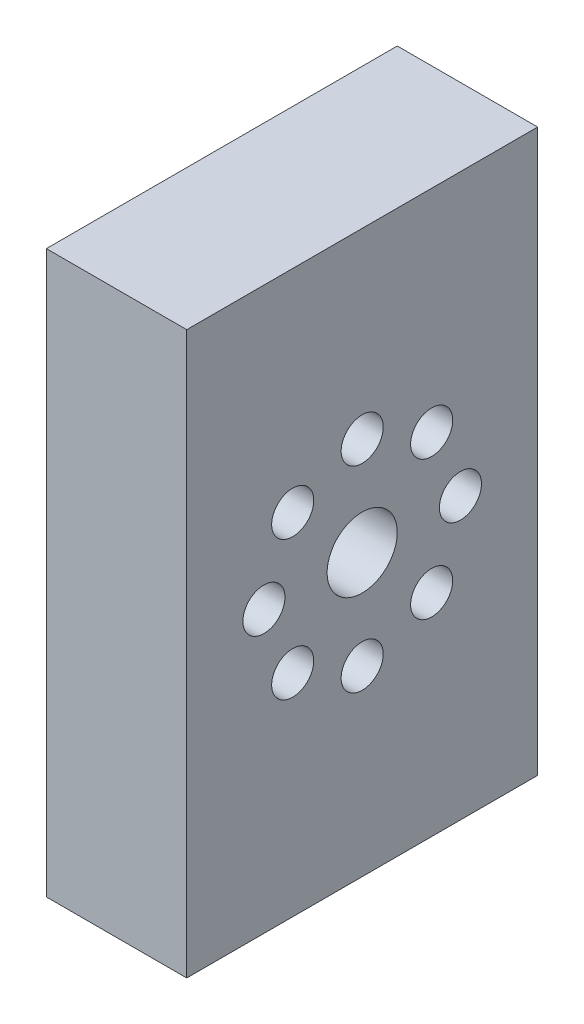
ISO-10303-21;
HEADER;
FILE_DESCRIPTION(('STEP AP214'),'2;1');
FILE_NAME('part.step','',(''),(''),'','','');
FILE_SCHEMA(('AUTOMOTIVE_DESIGN { 1 0 10303 214 1 1 1 1 }'));
ENDSEC;
DATA;
#1=APPLICATION_CONTEXT('core data for automotive mechanical design processes');
#2=APPLICATION_PROTOCOL_DEFINITION('international standard','automotive_design',2000,#1);
#3=PRODUCT_CONTEXT('',#1,'mechanical');
#4=PRODUCT('Part','Part','',(#3));
#5=PRODUCT_RELATED_PRODUCT_CATEGORY('part','',(#4));
#6=PRODUCT_DEFINITION_FORMATION('','',#4);
#7=PRODUCT_DEFINITION_CONTEXT('part definition',#1,'design');
#8=PRODUCT_DEFINITION('design','',#6,#7);
#9=PRODUCT_DEFINITION_SHAPE('','',#8);
#10=(LENGTH_UNIT() NAMED_UNIT(*) SI_UNIT(.MILLI.,.METRE.));
#11=(NAMED_UNIT(*) PLANE_ANGLE_UNIT() SI_UNIT($,.RADIAN.));
#12=(NAMED_UNIT(*) SI_UNIT($,.STERADIAN.) SOLID_ANGLE_UNIT());
#13=UNCERTAINTY_MEASURE_WITH_UNIT(LENGTH_MEASURE(1.E-05),#10,'distance_accuracy_value','');
#14=(GEOMETRIC_REPRESENTATION_CONTEXT(3) GLOBAL_UNCERTAINTY_ASSIGNED_CONTEXT((#13)) GLOBAL_UNIT_ASSIGNED_CONTEXT((#10,
#11,#12)) REPRESENTATION_CONTEXT('',''));
#15=CARTESIAN_POINT('',(0.,0.,0.));
#16=DIRECTION('',(0.,0.,1.));
#17=DIRECTION('',(1.,0.,0.));
#18=AXIS2_PLACEMENT_3D('',#15,#16,#17);
#19=CARTESIAN_POINT('',(-14.4613506272435,0.,0.));
#20=DIRECTION('',(-1.,0.,0.));
#21=DIRECTION('',(0.,0.,1.));
#22=AXIS2_PLACEMENT_3D('',#19,#20,#21);
#23=PLANE('',#22);
#24=CARTESIAN_POINT('',(-14.4613506272435,0.,0.));
#25=DIRECTION('',(-1.,0.,0.));
#26=DIRECTION('',(0.,0.,1.));
#27=AXIS2_PLACEMENT_3D('',#24,#25,#26);
#28=CIRCLE('',#27,2.5);
#29=CARTESIAN_POINT('',(-14.4613506272435,0.,2.5));
#30=VERTEX_POINT('',#29);
#31=EDGE_CURVE('E109',#30,#30,#28,.T.);
#32=ORIENTED_EDGE('',*,*,#31,.T.);
#33=EDGE_LOOP('',(#32));
#34=FACE_BOUND('',#33,.T.);
#35=CARTESIAN_POINT('',(-14.4613506272435,-7.,0.));
#36=DIRECTION('',(1.,0.,0.));
#37=DIRECTION('',(0.,0.,1.));
#38=AXIS2_PLACEMENT_3D('',#35,#36,#37);
#39=CIRCLE('',#38,1.5);
#40=CARTESIAN_POINT('',(-14.4613506272435,-7.,1.5));
#41=VERTEX_POINT('',#40);
#42=EDGE_CURVE('E130',#41,#41,#39,.T.);
#43=ORIENTED_EDGE('',*,*,#42,.F.);
#44=EDGE_LOOP('',(#43));
#45=FACE_BOUND('',#44,.T.);
#46=CARTESIAN_POINT('',(-14.4613506272435,-4.94974746830601,4.94974746830591));
#47=DIRECTION('',(1.,0.,0.));
#48=DIRECTION('',(0.,0.,1.));
#49=AXIS2_PLACEMENT_3D('',#46,#47,#48);
#50=CIRCLE('',#49,1.5);
#51=CARTESIAN_POINT('',(-14.4613506272435,-4.94974746830601,6.44974746830591));
#52=VERTEX_POINT('',#51);
#53=EDGE_CURVE('E118',#52,#52,#50,.T.);
#54=ORIENTED_EDGE('',*,*,#53,.F.);
#55=EDGE_LOOP('',(#54));
#56=FACE_BOUND('',#55,.T.);
#57=CARTESIAN_POINT('',(-14.4613506272435,-4.94974746830565,-4.94974746830576));
#58=DIRECTION('',(1.,0.,0.));
#59=DIRECTION('',(0.,0.,1.));
#60=AXIS2_PLACEMENT_3D('',#57,#58,#59);
#61=CIRCLE('',#60,1.5);
#62=CARTESIAN_POINT('',(-14.4613506272435,-4.94974746830565,-3.44974746830576));
#63=VERTEX_POINT('',#62);
#64=EDGE_CURVE('E125',#63,#63,#61,.T.);
#65=ORIENTED_EDGE('',*,*,#64,.F.);
#66=EDGE_LOOP('',(#65));
#67=FACE_BOUND('',#66,.T.);
#68=CARTESIAN_POINT('',(-14.4613506272435,7.,0.));
#69=DIRECTION('',(-1.,0.,0.));
#70=DIRECTION('',(0.,0.,1.));
#71=AXIS2_PLACEMENT_3D('',#68,#69,#70);
#72=CIRCLE('',#71,1.5);
#73=CARTESIAN_POINT('',(-14.4613506272435,7.,1.5));
#74=VERTEX_POINT('',#73);
#75=EDGE_CURVE('E101',#74,#74,#72,.T.);
#76=ORIENTED_EDGE('',*,*,#75,.T.);
#77=EDGE_LOOP('',(#76));
#78=FACE_BOUND('',#77,.T.);
#79=CARTESIAN_POINT('',(-14.4613506272435,4.94974746830601,4.94974746830591));
#80=DIRECTION('',(-1.,0.,0.));
#81=DIRECTION('',(0.,0.,1.));
#82=AXIS2_PLACEMENT_3D('',#79,#80,#81);
#83=CIRCLE('',#82,1.5);
#84=CARTESIAN_POINT('',(-14.4613506272435,4.94974746830601,6.44974746830591));
#85=VERTEX_POINT('',#84);
#86=EDGE_CURVE('E136',#85,#85,#83,.T.);
#87=ORIENTED_EDGE('',*,*,#86,.T.);
#88=EDGE_LOOP('',(#87));
#89=FACE_BOUND('',#88,.T.);
#90=CARTESIAN_POINT('',(-14.4613506272435,-2.55611687853764E-13,-6.99999999999975));
#91=DIRECTION('',(-1.,0.,0.));
#92=DIRECTION('',(0.,0.,1.));
#93=AXIS2_PLACEMENT_3D('',#90,#91,#92);
#94=CIRCLE('',#93,1.5);
#95=CARTESIAN_POINT('',(-14.4613506272435,-2.55611687853764E-13,-5.49999999999975));
#96=VERTEX_POINT('',#95);
#97=EDGE_CURVE('E148',#96,#96,#94,.T.);
#98=ORIENTED_EDGE('',*,*,#97,.T.);
#99=EDGE_LOOP('',(#98));
#100=FACE_BOUND('',#99,.T.);
#101=CARTESIAN_POINT('',(-14.4613506272435,4.94974746830565,-4.94974746830576));
#102=DIRECTION('',(-1.,0.,0.));
#103=DIRECTION('',(0.,0.,1.));
#104=AXIS2_PLACEMENT_3D('',#101,#102,#103);
#105=CIRCLE('',#104,1.5);
#106=CARTESIAN_POINT('',(-14.4613506272435,4.94974746830565,-3.44974746830576));
#107=VERTEX_POINT('',#106);
#108=EDGE_CURVE('E154',#107,#107,#105,.T.);
#109=ORIENTED_EDGE('',*,*,#108,.T.);
#110=EDGE_LOOP('',(#109));
#111=FACE_BOUND('',#110,.T.);
#112=CARTESIAN_POINT('',(-14.4613506272435,2.54754435094361E-13,7.00000000000025));
#113=DIRECTION('',(-1.,0.,0.));
#114=DIRECTION('',(0.,0.,1.));
#115=AXIS2_PLACEMENT_3D('',#112,#113,#114);
#116=CIRCLE('',#115,1.5);
#117=CARTESIAN_POINT('',(-14.4613506272435,2.54754435094361E-13,8.50000000000025));
#118=VERTEX_POINT('',#117);
#119=EDGE_CURVE('E142',#118,#118,#116,.T.);
#120=ORIENTED_EDGE('',*,*,#119,.T.);
#121=EDGE_LOOP('',(#120));
#122=FACE_BOUND('',#121,.T.);
#123=DIRECTION('',(0.,-1.,0.));
#124=VECTOR('',#123,1.);
#125=CARTESIAN_POINT('',(-14.4613506272435,-36.111814630847,-12.5000001862645));
#126=LINE('',#125,#124);
#127=CARTESIAN_POINT('',(-14.4613506272435,20.,-12.5000001862645));
#128=VERTEX_POINT('',#127);
#129=CARTESIAN_POINT('',(-14.4613506272435,-20.,-12.5000001862645));
#130=VERTEX_POINT('',#129);
#131=EDGE_CURVE('E94',#128,#130,#126,.T.);
#132=ORIENTED_EDGE('',*,*,#131,.F.);
#133=DIRECTION('',(0.,0.,1.));
#134=VECTOR('',#133,1.);
#135=CARTESIAN_POINT('',(-14.4613506272435,20.,0.));
#136=LINE('',#135,#134);
#137=CARTESIAN_POINT('',(-14.4613506272435,20.,12.5000001862645));
#138=VERTEX_POINT('',#137);
#139=EDGE_CURVE('E115',#128,#138,#136,.T.);
#140=ORIENTED_EDGE('',*,*,#139,.T.);
#141=DIRECTION('',(0.,1.,0.));
#142=VECTOR('',#141,1.);
#143=CARTESIAN_POINT('',(-14.4613506272435,34.988607051957,12.5000001862645));
#144=LINE('',#143,#142);
#145=CARTESIAN_POINT('',(-14.4613506272435,-20.,12.5000001862645));
#146=VERTEX_POINT('',#145);
#147=EDGE_CURVE('E86',#146,#138,#144,.T.);
#148=ORIENTED_EDGE('',*,*,#147,.F.);
#149=DIRECTION('',(0.,0.,-1.));
#150=VECTOR('',#149,1.);
#151=CARTESIAN_POINT('',(-14.4613506272435,-20.,0.));
#152=LINE('',#151,#150);
#153=EDGE_CURVE('E113',#146,#130,#152,.T.);
#154=ORIENTED_EDGE('',*,*,#153,.T.);
#155=EDGE_LOOP('',(#132,#140,#148,#154));
#156=FACE_BOUND('',#155,.T.);
#157=ADVANCED_FACE('F36',(#34,#45,#56,#67,#78,#89,#100,#111,#122,#156),#23,.F.);
#158=CARTESIAN_POINT('',(-14.4613506272435,7.,0.));
#159=DIRECTION('',(-1.,0.,0.));
#160=DIRECTION('',(0.,0.,1.));
#161=AXIS2_PLACEMENT_3D('',#158,#159,#160);
#162=CYLINDRICAL_SURFACE('',#161,1.5);
#163=ORIENTED_EDGE('',*,*,#75,.F.);
#164=EDGE_LOOP('',(#163));
#165=FACE_BOUND('',#164,.T.);
#166=CARTESIAN_POINT('',(-24.4613506272435,7.,0.));
#167=DIRECTION('',(-1.,0.,0.));
#168=DIRECTION('',(0.,0.,1.));
#169=AXIS2_PLACEMENT_3D('',#166,#167,#168);
#170=CIRCLE('',#169,1.5);
#171=CARTESIAN_POINT('',(-24.4613506272435,7.,1.5));
#172=VERTEX_POINT('',#171);
#173=EDGE_CURVE('E97',#172,#172,#170,.T.);
#174=ORIENTED_EDGE('',*,*,#173,.T.);
#175=EDGE_LOOP('',(#174));
#176=FACE_BOUND('',#175,.T.);
#177=ADVANCED_FACE('F164',(#165,#176),#162,.F.);
#178=CARTESIAN_POINT('',(-14.4613506272435,4.94974746830601,4.94974746830591));
#179=DIRECTION('',(-1.,0.,0.));
#180=DIRECTION('',(0.,0.,1.));
#181=AXIS2_PLACEMENT_3D('',#178,#179,#180);
#182=CYLINDRICAL_SURFACE('',#181,1.5);
#183=ORIENTED_EDGE('',*,*,#86,.F.);
#184=EDGE_LOOP('',(#183));
#185=FACE_BOUND('',#184,.T.);
#186=CARTESIAN_POINT('',(-24.4613506272435,4.94974746830601,4.94974746830591));
#187=DIRECTION('',(-1.,0.,0.));
#188=DIRECTION('',(0.,0.,1.));
#189=AXIS2_PLACEMENT_3D('',#186,#187,#188);
#190=CIRCLE('',#189,1.5);
#191=CARTESIAN_POINT('',(-24.4613506272435,4.94974746830601,6.44974746830591));
#192=VERTEX_POINT('',#191);
#193=EDGE_CURVE('E139',#192,#192,#190,.T.);
#194=ORIENTED_EDGE('',*,*,#193,.T.);
#195=EDGE_LOOP('',(#194));
#196=FACE_BOUND('',#195,.T.);
#197=ADVANCED_FACE('F195',(#185,#196),#182,.F.);
#198=CARTESIAN_POINT('',(-14.4613506272435,4.94974746830565,-4.94974746830576));
#199=DIRECTION('',(-1.,0.,0.));
#200=DIRECTION('',(0.,0.,1.));
#201=AXIS2_PLACEMENT_3D('',#198,#199,#200);
#202=CYLINDRICAL_SURFACE('',#201,1.5);
#203=ORIENTED_EDGE('',*,*,#108,.F.);
#204=EDGE_LOOP('',(#203));
#205=FACE_BOUND('',#204,.T.);
#206=CARTESIAN_POINT('',(-24.4613506272435,4.94974746830565,-4.94974746830576));
#207=DIRECTION('',(-1.,0.,0.));
#208=DIRECTION('',(0.,0.,1.));
#209=AXIS2_PLACEMENT_3D('',#206,#207,#208);
#210=CIRCLE('',#209,1.5);
#211=CARTESIAN_POINT('',(-24.4613506272435,4.94974746830565,-3.44974746830576));
#212=VERTEX_POINT('',#211);
#213=EDGE_CURVE('E133',#212,#212,#210,.T.);
#214=ORIENTED_EDGE('',*,*,#213,.T.);
#215=EDGE_LOOP('',(#214));
#216=FACE_BOUND('',#215,.T.);
#217=ADVANCED_FACE('F206',(#205,#216),#202,.F.);
#218=CARTESIAN_POINT('',(0.,0.,-12.5000001862645));
#219=DIRECTION('',(0.,0.,-1.));
#220=DIRECTION('',(-1.,0.,0.));
#221=AXIS2_PLACEMENT_3D('',#218,#219,#220);
#222=PLANE('',#221);
#223=DIRECTION('',(1.,0.,0.));
#224=VECTOR('',#223,1.);
#225=CARTESIAN_POINT('',(-29.8296181730459,20.,-12.5000001862645));
#226=LINE('',#225,#224);
#227=CARTESIAN_POINT('',(-24.4613506272435,20.,-12.5000001862645));
#228=VERTEX_POINT('',#227);
#229=EDGE_CURVE('E58',#228,#128,#226,.T.);
#230=ORIENTED_EDGE('',*,*,#229,.T.);
#231=ORIENTED_EDGE('',*,*,#131,.T.);
#232=DIRECTION('',(-1.,0.,0.));
#233=VECTOR('',#232,1.);
#234=CARTESIAN_POINT('',(-29.8296181730459,-20.,-12.5000001862645));
#235=LINE('',#234,#233);
#236=CARTESIAN_POINT('',(-24.4613506272435,-20.,-12.5000001862645));
#237=VERTEX_POINT('',#236);
#238=EDGE_CURVE('E87',#130,#237,#235,.T.);
#239=ORIENTED_EDGE('',*,*,#238,.T.);
#240=DIRECTION('',(0.,-1.,0.));
#241=VECTOR('',#240,1.);
#242=CARTESIAN_POINT('',(-24.4613506272435,45.9886125211115,-12.5000001862645));
#243=LINE('',#242,#241);
#244=EDGE_CURVE('E91',#228,#237,#243,.T.);
#245=ORIENTED_EDGE('',*,*,#244,.F.);
#246=EDGE_LOOP('',(#230,#231,#239,#245));
#247=FACE_BOUND('',#246,.T.);
#248=ADVANCED_FACE('F106',(#247),#222,.T.);
#249=CARTESIAN_POINT('',(0.,0.,12.5000001862645));
#250=DIRECTION('',(0.,0.,1.));
#251=DIRECTION('',(1.,0.,0.));
#252=AXIS2_PLACEMENT_3D('',#249,#250,#251);
#253=PLANE('',#252);
#254=DIRECTION('',(1.,0.,0.));
#255=VECTOR('',#254,1.);
#256=CARTESIAN_POINT('',(-29.8296181730459,20.,12.5000001862645));
#257=LINE('',#256,#255);
#258=CARTESIAN_POINT('',(-24.4613506272435,20.,12.5000001862645));
#259=VERTEX_POINT('',#258);
#260=EDGE_CURVE('E75',#259,#138,#257,.T.);
#261=ORIENTED_EDGE('',*,*,#260,.F.);
#262=DIRECTION('',(0.,1.,0.));
#263=VECTOR('',#262,1.);
#264=CARTESIAN_POINT('',(-24.4613506272435,36.1027433116079,12.5000001862645));
#265=LINE('',#264,#263);
#266=CARTESIAN_POINT('',(-24.4613506272435,-20.,12.5000001862645));
#267=VERTEX_POINT('',#266);
#268=EDGE_CURVE('E84',#267,#259,#265,.T.);
#269=ORIENTED_EDGE('',*,*,#268,.F.);
#270=DIRECTION('',(-1.,0.,0.));
#271=VECTOR('',#270,1.);
#272=CARTESIAN_POINT('',(-29.8296181730459,-20.,12.5000001862645));
#273=LINE('',#272,#271);
#274=EDGE_CURVE('E51',#146,#267,#273,.T.);
#275=ORIENTED_EDGE('',*,*,#274,.F.);
#276=ORIENTED_EDGE('',*,*,#147,.T.);
#277=EDGE_LOOP('',(#261,#269,#275,#276));
#278=FACE_BOUND('',#277,.T.);
#279=ADVANCED_FACE('F38',(#278),#253,.T.);
#280=CARTESIAN_POINT('',(-24.4613506272435,0.,0.));
#281=DIRECTION('',(-1.,0.,0.));
#282=DIRECTION('',(0.,0.,1.));
#283=AXIS2_PLACEMENT_3D('',#280,#281,#282);
#284=PLANE('',#283);
#285=CARTESIAN_POINT('',(-24.4613506272435,0.,0.));
#286=DIRECTION('',(-1.,0.,0.));
#287=DIRECTION('',(0.,0.,1.));
#288=AXIS2_PLACEMENT_3D('',#285,#286,#287);
#289=CIRCLE('',#288,2.5);
#290=CARTESIAN_POINT('',(-24.4613506272435,0.,2.5));
#291=VERTEX_POINT('',#290);
#292=EDGE_CURVE('E239',#291,#291,#289,.T.);
#293=ORIENTED_EDGE('',*,*,#292,.F.);
#294=EDGE_LOOP('',(#293));
#295=FACE_BOUND('',#294,.T.);
#296=DIRECTION('',(0.,0.,1.));
#297=VECTOR('',#296,1.);
#298=CARTESIAN_POINT('',(-24.4613506272435,20.,0.));
#299=LINE('',#298,#297);
#300=EDGE_CURVE('E11',#228,#259,#299,.T.);
#301=ORIENTED_EDGE('',*,*,#300,.F.);
#302=ORIENTED_EDGE('',*,*,#244,.T.);
#303=DIRECTION('',(0.,0.,-1.));
#304=VECTOR('',#303,1.);
#305=CARTESIAN_POINT('',(-24.4613506272435,-20.,0.));
#306=LINE('',#305,#304);
#307=EDGE_CURVE('E44',#267,#237,#306,.T.);
#308=ORIENTED_EDGE('',*,*,#307,.F.);
#309=ORIENTED_EDGE('',*,*,#268,.T.);
#310=EDGE_LOOP('',(#301,#302,#308,#309));
#311=FACE_BOUND('',#310,.T.);
#312=CARTESIAN_POINT('',(-24.4613506272435,2.54754435094361E-13,7.00000000000025));
#313=DIRECTION('',(-1.,0.,0.));
#314=DIRECTION('',(0.,0.,1.));
#315=AXIS2_PLACEMENT_3D('',#312,#313,#314);
#316=CIRCLE('',#315,1.5);
#317=CARTESIAN_POINT('',(-24.4613506272435,2.54754435094361E-13,8.50000000000025));
#318=VERTEX_POINT('',#317);
#319=EDGE_CURVE('E145',#318,#318,#316,.T.);
#320=ORIENTED_EDGE('',*,*,#319,.F.);
#321=EDGE_LOOP('',(#320));
#322=FACE_BOUND('',#321,.T.);
#323=CARTESIAN_POINT('',(-24.4613506272435,-2.55611687853764E-13,-6.99999999999975));
#324=DIRECTION('',(-1.,0.,0.));
#325=DIRECTION('',(0.,0.,1.));
#326=AXIS2_PLACEMENT_3D('',#323,#324,#325);
#327=CIRCLE('',#326,1.5);
#328=CARTESIAN_POINT('',(-24.4613506272435,-2.55611687853764E-13,-5.49999999999975));
#329=VERTEX_POINT('',#328);
#330=EDGE_CURVE('E151',#329,#329,#327,.T.);
#331=ORIENTED_EDGE('',*,*,#330,.F.);
#332=EDGE_LOOP('',(#331));
#333=FACE_BOUND('',#332,.T.);
#334=ORIENTED_EDGE('',*,*,#213,.F.);
#335=EDGE_LOOP('',(#334));
#336=FACE_BOUND('',#335,.T.);
#337=ORIENTED_EDGE('',*,*,#193,.F.);
#338=EDGE_LOOP('',(#337));
#339=FACE_BOUND('',#338,.T.);
#340=ORIENTED_EDGE('',*,*,#173,.F.);
#341=EDGE_LOOP('',(#340));
#342=FACE_BOUND('',#341,.T.);
#343=CARTESIAN_POINT('',(-24.4613506272435,-4.94974746830565,-4.94974746830576));
#344=DIRECTION('',(1.,0.,0.));
#345=DIRECTION('',(0.,0.,1.));
#346=AXIS2_PLACEMENT_3D('',#343,#344,#345);
#347=CIRCLE('',#346,1.5);
#348=CARTESIAN_POINT('',(-24.4613506272435,-4.94974746830565,-3.44974746830576));
#349=VERTEX_POINT('',#348);
#350=EDGE_CURVE('E117',#349,#349,#347,.T.);
#351=ORIENTED_EDGE('',*,*,#350,.T.);
#352=EDGE_LOOP('',(#351));
#353=FACE_BOUND('',#352,.T.);
#354=CARTESIAN_POINT('',(-24.4613506272435,-4.94974746830601,4.94974746830591));
#355=DIRECTION('',(1.,0.,0.));
#356=DIRECTION('',(0.,0.,1.));
#357=AXIS2_PLACEMENT_3D('',#354,#355,#356);
#358=CIRCLE('',#357,1.5);
#359=CARTESIAN_POINT('',(-24.4613506272435,-4.94974746830601,6.44974746830591));
#360=VERTEX_POINT('',#359);
#361=EDGE_CURVE('E122',#360,#360,#358,.T.);
#362=ORIENTED_EDGE('',*,*,#361,.T.);
#363=EDGE_LOOP('',(#362));
#364=FACE_BOUND('',#363,.T.);
#365=CARTESIAN_POINT('',(-24.4613506272435,-7.,0.));
#366=DIRECTION('',(1.,0.,0.));
#367=DIRECTION('',(0.,0.,1.));
#368=AXIS2_PLACEMENT_3D('',#365,#366,#367);
#369=CIRCLE('',#368,1.5);
#370=CARTESIAN_POINT('',(-24.4613506272435,-7.,1.5));
#371=VERTEX_POINT('',#370);
#372=EDGE_CURVE('E121',#371,#371,#369,.T.);
#373=ORIENTED_EDGE('',*,*,#372,.T.);
#374=EDGE_LOOP('',(#373));
#375=FACE_BOUND('',#374,.T.);
#376=ADVANCED_FACE('F89',(#295,#311,#322,#333,#336,#339,#342,#353,#364,#375),#284,.T.);
#377=CARTESIAN_POINT('',(-14.4613506272435,-2.55611687853764E-13,-6.99999999999975));
#378=DIRECTION('',(-1.,0.,0.));
#379=DIRECTION('',(0.,0.,1.));
#380=AXIS2_PLACEMENT_3D('',#377,#378,#379);
#381=CYLINDRICAL_SURFACE('',#380,1.5);
#382=ORIENTED_EDGE('',*,*,#97,.F.);
#383=EDGE_LOOP('',(#382));
#384=FACE_BOUND('',#383,.T.);
#385=ORIENTED_EDGE('',*,*,#330,.T.);
#386=EDGE_LOOP('',(#385));
#387=FACE_BOUND('',#386,.T.);
#388=ADVANCED_FACE('F168',(#384,#387),#381,.F.);
#389=CARTESIAN_POINT('',(-14.4613506272435,2.54754435094361E-13,7.00000000000025));
#390=DIRECTION('',(-1.,0.,0.));
#391=DIRECTION('',(0.,0.,1.));
#392=AXIS2_PLACEMENT_3D('',#389,#390,#391);
#393=CYLINDRICAL_SURFACE('',#392,1.5);
#394=ORIENTED_EDGE('',*,*,#319,.T.);
#395=EDGE_LOOP('',(#394));
#396=FACE_BOUND('',#395,.T.);
#397=ORIENTED_EDGE('',*,*,#119,.F.);
#398=EDGE_LOOP('',(#397));
#399=FACE_BOUND('',#398,.T.);
#400=ADVANCED_FACE('F180',(#396,#399),#393,.F.);
#401=CARTESIAN_POINT('',(-14.4613506272435,-7.,0.));
#402=DIRECTION('',(-1.,0.,0.));
#403=DIRECTION('',(0.,0.,1.));
#404=AXIS2_PLACEMENT_3D('',#401,#402,#403);
#405=CYLINDRICAL_SURFACE('',#404,1.5);
#406=ORIENTED_EDGE('',*,*,#42,.T.);
#407=EDGE_LOOP('',(#406));
#408=FACE_BOUND('',#407,.T.);
#409=ORIENTED_EDGE('',*,*,#372,.F.);
#410=EDGE_LOOP('',(#409));
#411=FACE_BOUND('',#410,.T.);
#412=ADVANCED_FACE('F177',(#408,#411),#405,.F.);
#413=CARTESIAN_POINT('',(-14.4613506272435,-4.94974746830601,4.94974746830591));
#414=DIRECTION('',(-1.,0.,0.));
#415=DIRECTION('',(0.,0.,1.));
#416=AXIS2_PLACEMENT_3D('',#413,#414,#415);
#417=CYLINDRICAL_SURFACE('',#416,1.5);
#418=ORIENTED_EDGE('',*,*,#53,.T.);
#419=EDGE_LOOP('',(#418));
#420=FACE_BOUND('',#419,.T.);
#421=ORIENTED_EDGE('',*,*,#361,.F.);
#422=EDGE_LOOP('',(#421));
#423=FACE_BOUND('',#422,.T.);
#424=ADVANCED_FACE('F179',(#420,#423),#417,.F.);
#425=CARTESIAN_POINT('',(-14.4613506272435,-4.94974746830565,-4.94974746830576));
#426=DIRECTION('',(-1.,0.,0.));
#427=DIRECTION('',(0.,0.,1.));
#428=AXIS2_PLACEMENT_3D('',#425,#426,#427);
#429=CYLINDRICAL_SURFACE('',#428,1.5);
#430=ORIENTED_EDGE('',*,*,#64,.T.);
#431=EDGE_LOOP('',(#430));
#432=FACE_BOUND('',#431,.T.);
#433=ORIENTED_EDGE('',*,*,#350,.F.);
#434=EDGE_LOOP('',(#433));
#435=FACE_BOUND('',#434,.T.);
#436=ADVANCED_FACE('F187',(#432,#435),#429,.F.);
#437=CARTESIAN_POINT('',(-29.8296181730459,-20.,-12.5000001862645));
#438=DIRECTION('',(0.,1.,0.));
#439=DIRECTION('',(0.,0.,1.));
#440=AXIS2_PLACEMENT_3D('',#437,#438,#439);
#441=PLANE('',#440);
#442=ORIENTED_EDGE('',*,*,#274,.T.);
#443=ORIENTED_EDGE('',*,*,#307,.T.);
#444=ORIENTED_EDGE('',*,*,#238,.F.);
#445=ORIENTED_EDGE('',*,*,#153,.F.);
#446=EDGE_LOOP('',(#442,#443,#444,#445));
#447=FACE_BOUND('',#446,.T.);
#448=ADVANCED_FACE('F103',(#447),#441,.F.);
#449=CARTESIAN_POINT('',(-29.8296181730459,20.,-12.5000001862645));
#450=DIRECTION('',(0.,-1.,0.));
#451=DIRECTION('',(0.,0.,-1.));
#452=AXIS2_PLACEMENT_3D('',#449,#450,#451);
#453=PLANE('',#452);
#454=ORIENTED_EDGE('',*,*,#229,.F.);
#455=ORIENTED_EDGE('',*,*,#300,.T.);
#456=ORIENTED_EDGE('',*,*,#260,.T.);
#457=ORIENTED_EDGE('',*,*,#139,.F.);
#458=EDGE_LOOP('',(#454,#455,#456,#457));
#459=FACE_BOUND('',#458,.T.);
#460=ADVANCED_FACE('F74',(#459),#453,.F.);
#461=CARTESIAN_POINT('',(-14.4613506272435,0.,0.));
#462=DIRECTION('',(-1.,0.,0.));
#463=DIRECTION('',(0.,0.,1.));
#464=AXIS2_PLACEMENT_3D('',#461,#462,#463);
#465=CYLINDRICAL_SURFACE('',#464,2.5);
#466=ORIENTED_EDGE('',*,*,#31,.F.);
#467=EDGE_LOOP('',(#466));
#468=FACE_BOUND('',#467,.T.);
#469=ORIENTED_EDGE('',*,*,#292,.T.);
#470=EDGE_LOOP('',(#469));
#471=FACE_BOUND('',#470,.T.);
#472=ADVANCED_FACE('F244',(#468,#471),#465,.F.);
#473=CLOSED_SHELL('',(#157,#177,#197,#217,#248,#279,#376,#388,#400,#412,#424,#436,#448,#460,#472));
#474=MANIFOLD_SOLID_BREP('B2',#473);
#475=ADVANCED_BREP_SHAPE_REPRESENTATION('',(#18,#474),#14);
#476=SHAPE_DEFINITION_REPRESENTATION(#9,#475);
ENDSEC;
END-ISO-10303-21;
